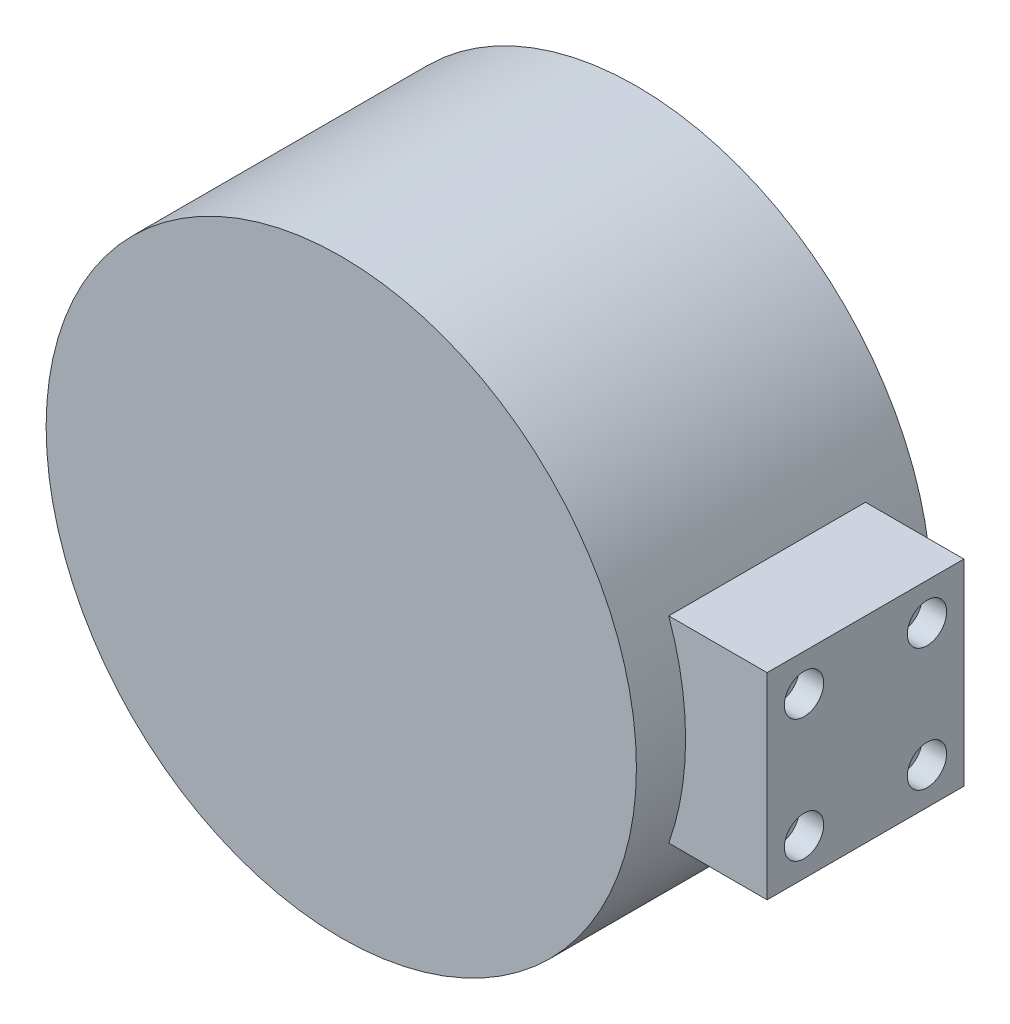
ISO-10303-21;
HEADER;
FILE_DESCRIPTION(('STEP AP214'),'2;1');
FILE_NAME('part.step','',(''),(''),'','','');
FILE_SCHEMA(('AUTOMOTIVE_DESIGN { 1 0 10303 214 1 1 1 1 }'));
ENDSEC;
DATA;
#1=APPLICATION_CONTEXT('core data for automotive mechanical design processes');
#2=APPLICATION_PROTOCOL_DEFINITION('international standard','automotive_design',2000,#1);
#3=PRODUCT_CONTEXT('',#1,'mechanical');
#4=PRODUCT('Part','Part','',(#3));
#5=PRODUCT_RELATED_PRODUCT_CATEGORY('part','',(#4));
#6=PRODUCT_DEFINITION_FORMATION('','',#4);
#7=PRODUCT_DEFINITION_CONTEXT('part definition',#1,'design');
#8=PRODUCT_DEFINITION('design','',#6,#7);
#9=PRODUCT_DEFINITION_SHAPE('','',#8);
#10=(LENGTH_UNIT() NAMED_UNIT(*) SI_UNIT(.MILLI.,.METRE.));
#11=(NAMED_UNIT(*) PLANE_ANGLE_UNIT() SI_UNIT($,.RADIAN.));
#12=(NAMED_UNIT(*) SI_UNIT($,.STERADIAN.) SOLID_ANGLE_UNIT());
#13=UNCERTAINTY_MEASURE_WITH_UNIT(LENGTH_MEASURE(1.E-05),#10,'distance_accuracy_value','');
#14=(GEOMETRIC_REPRESENTATION_CONTEXT(3) GLOBAL_UNCERTAINTY_ASSIGNED_CONTEXT((#13)) GLOBAL_UNIT_ASSIGNED_CONTEXT((#10,
#11,#12)) REPRESENTATION_CONTEXT('',''));
#15=CARTESIAN_POINT('',(0.,0.,0.));
#16=DIRECTION('',(0.,0.,1.));
#17=DIRECTION('',(1.,0.,0.));
#18=AXIS2_PLACEMENT_3D('',#15,#16,#17);
#19=CARTESIAN_POINT('',(56.5685424949238,-20.,60.));
#20=DIRECTION('',(0.,1.,0.));
#21=DIRECTION('',(-1.,0.,0.));
#22=AXIS2_PLACEMENT_3D('',#19,#20,#21);
#23=PLANE('',#22);
#24=DIRECTION('',(1.,0.,0.));
#25=VECTOR('',#24,1.);
#26=CARTESIAN_POINT('',(76.5685424949238,-20.,50.));
#27=LINE('',#26,#25);
#28=CARTESIAN_POINT('',(56.5685424949238,-20.,50.));
#29=VERTEX_POINT('',#28);
#30=CARTESIAN_POINT('',(76.5685424949238,-20.,50.));
#31=VERTEX_POINT('',#30);
#32=EDGE_CURVE('E76',#29,#31,#27,.T.);
#33=ORIENTED_EDGE('',*,*,#32,.F.);
#34=DIRECTION('',(0.,0.,-1.));
#35=VECTOR('',#34,1.);
#36=CARTESIAN_POINT('',(56.5685424949238,-20.,60.));
#37=LINE('',#36,#35);
#38=CARTESIAN_POINT('',(56.5685424949238,-20.,10.));
#39=VERTEX_POINT('',#38);
#40=EDGE_CURVE('E11',#29,#39,#37,.T.);
#41=ORIENTED_EDGE('',*,*,#40,.T.);
#42=DIRECTION('',(-1.,0.,0.));
#43=VECTOR('',#42,1.);
#44=CARTESIAN_POINT('',(76.5685424949238,-20.,10.));
#45=LINE('',#44,#43);
#46=CARTESIAN_POINT('',(76.5685424949238,-20.,10.));
#47=VERTEX_POINT('',#46);
#48=EDGE_CURVE('E107',#47,#39,#45,.T.);
#49=ORIENTED_EDGE('',*,*,#48,.F.);
#50=DIRECTION('',(0.,0.,-1.));
#51=VECTOR('',#50,1.);
#52=CARTESIAN_POINT('',(76.5685424949238,-20.,60.));
#53=LINE('',#52,#51);
#54=EDGE_CURVE('E41',#31,#47,#53,.T.);
#55=ORIENTED_EDGE('',*,*,#54,.F.);
#56=EDGE_LOOP('',(#33,#41,#49,#55));
#57=FACE_BOUND('',#56,.T.);
#58=ADVANCED_FACE('F33',(#57),#23,.F.);
#59=CARTESIAN_POINT('',(76.5685424949238,-20.,60.));
#60=DIRECTION('',(-1.,0.,0.));
#61=DIRECTION('',(0.,0.,1.));
#62=AXIS2_PLACEMENT_3D('',#59,#60,#61);
#63=PLANE('',#62);
#64=CARTESIAN_POINT('',(76.5685424949238,12.5,42.5));
#65=DIRECTION('',(1.,0.,0.));
#66=DIRECTION('',(0.,0.,-1.));
#67=AXIS2_PLACEMENT_3D('',#64,#65,#66);
#68=CIRCLE('',#67,4.00000000000001);
#69=CARTESIAN_POINT('',(76.5685424949238,12.5,38.5));
#70=VERTEX_POINT('',#69);
#71=EDGE_CURVE('E128',#70,#70,#68,.T.);
#72=ORIENTED_EDGE('',*,*,#71,.F.);
#73=EDGE_LOOP('',(#72));
#74=FACE_BOUND('',#73,.T.);
#75=CARTESIAN_POINT('',(76.5685424949238,-12.5,42.5));
#76=DIRECTION('',(1.,0.,0.));
#77=DIRECTION('',(0.,0.,-1.));
#78=AXIS2_PLACEMENT_3D('',#75,#76,#77);
#79=CIRCLE('',#78,4.00000000000001);
#80=CARTESIAN_POINT('',(76.5685424949238,-12.5,38.5));
#81=VERTEX_POINT('',#80);
#82=EDGE_CURVE('E134',#81,#81,#79,.T.);
#83=ORIENTED_EDGE('',*,*,#82,.F.);
#84=EDGE_LOOP('',(#83));
#85=FACE_BOUND('',#84,.T.);
#86=CARTESIAN_POINT('',(76.5685424949238,-12.5,17.5));
#87=DIRECTION('',(1.,0.,0.));
#88=DIRECTION('',(0.,0.,-1.));
#89=AXIS2_PLACEMENT_3D('',#86,#87,#88);
#90=CIRCLE('',#89,4.);
#91=CARTESIAN_POINT('',(76.5685424949238,-12.5,13.5));
#92=VERTEX_POINT('',#91);
#93=EDGE_CURVE('E140',#92,#92,#90,.T.);
#94=ORIENTED_EDGE('',*,*,#93,.F.);
#95=EDGE_LOOP('',(#94));
#96=FACE_BOUND('',#95,.T.);
#97=CARTESIAN_POINT('',(76.5685424949238,12.5,17.5));
#98=DIRECTION('',(1.,0.,0.));
#99=DIRECTION('',(0.,0.,-1.));
#100=AXIS2_PLACEMENT_3D('',#97,#98,#99);
#101=CIRCLE('',#100,4.);
#102=CARTESIAN_POINT('',(76.5685424949238,12.5,13.5));
#103=VERTEX_POINT('',#102);
#104=EDGE_CURVE('E122',#103,#103,#101,.T.);
#105=ORIENTED_EDGE('',*,*,#104,.F.);
#106=EDGE_LOOP('',(#105));
#107=FACE_BOUND('',#106,.T.);
#108=DIRECTION('',(0.,1.,0.));
#109=VECTOR('',#108,1.);
#110=CARTESIAN_POINT('',(76.5685424949238,20.,50.));
#111=LINE('',#110,#109);
#112=CARTESIAN_POINT('',(76.5685424949238,20.,50.));
#113=VERTEX_POINT('',#112);
#114=EDGE_CURVE('E82',#31,#113,#111,.T.);
#115=ORIENTED_EDGE('',*,*,#114,.F.);
#116=ORIENTED_EDGE('',*,*,#54,.T.);
#117=DIRECTION('',(0.,-1.,0.));
#118=VECTOR('',#117,1.);
#119=CARTESIAN_POINT('',(76.5685424949238,20.,10.));
#120=LINE('',#119,#118);
#121=CARTESIAN_POINT('',(76.5685424949238,20.,10.));
#122=VERTEX_POINT('',#121);
#123=EDGE_CURVE('E104',#122,#47,#120,.T.);
#124=ORIENTED_EDGE('',*,*,#123,.F.);
#125=DIRECTION('',(0.,0.,-1.));
#126=VECTOR('',#125,1.);
#127=CARTESIAN_POINT('',(76.5685424949238,20.,60.));
#128=LINE('',#127,#126);
#129=EDGE_CURVE('E91',#113,#122,#128,.T.);
#130=ORIENTED_EDGE('',*,*,#129,.F.);
#131=EDGE_LOOP('',(#115,#116,#124,#130));
#132=FACE_BOUND('',#131,.T.);
#133=ADVANCED_FACE('F103',(#74,#85,#96,#107,#132),#63,.F.);
#134=CARTESIAN_POINT('',(76.5685424949238,20.,60.));
#135=DIRECTION('',(0.,-1.,0.));
#136=DIRECTION('',(1.,0.,0.));
#137=AXIS2_PLACEMENT_3D('',#134,#135,#136);
#138=PLANE('',#137);
#139=DIRECTION('',(-1.,0.,0.));
#140=VECTOR('',#139,1.);
#141=CARTESIAN_POINT('',(76.5685424949238,20.,50.));
#142=LINE('',#141,#140);
#143=CARTESIAN_POINT('',(56.5685424949238,20.,50.));
#144=VERTEX_POINT('',#143);
#145=EDGE_CURVE('E77',#113,#144,#142,.T.);
#146=ORIENTED_EDGE('',*,*,#145,.F.);
#147=ORIENTED_EDGE('',*,*,#129,.T.);
#148=DIRECTION('',(1.,0.,0.));
#149=VECTOR('',#148,1.);
#150=CARTESIAN_POINT('',(76.5685424949238,20.,10.));
#151=LINE('',#150,#149);
#152=CARTESIAN_POINT('',(56.5685424949238,20.,10.));
#153=VERTEX_POINT('',#152);
#154=EDGE_CURVE('E90',#153,#122,#151,.T.);
#155=ORIENTED_EDGE('',*,*,#154,.F.);
#156=DIRECTION('',(0.,0.,-1.));
#157=VECTOR('',#156,1.);
#158=CARTESIAN_POINT('',(56.5685424949238,20.,60.));
#159=LINE('',#158,#157);
#160=EDGE_CURVE('E48',#144,#153,#159,.T.);
#161=ORIENTED_EDGE('',*,*,#160,.F.);
#162=EDGE_LOOP('',(#146,#147,#155,#161));
#163=FACE_BOUND('',#162,.T.);
#164=ADVANCED_FACE('F88',(#163),#138,.F.);
#165=CARTESIAN_POINT('',(0.,0.,60.));
#166=DIRECTION('',(0.,0.,1.));
#167=DIRECTION('',(1.,0.,0.));
#168=AXIS2_PLACEMENT_3D('',#165,#166,#167);
#169=PLANE('',#168);
#170=CARTESIAN_POINT('',(0.,0.,60.));
#171=DIRECTION('',(0.,0.,1.));
#172=DIRECTION('',(1.,0.,0.));
#173=AXIS2_PLACEMENT_3D('',#170,#171,#172);
#174=CIRCLE('',#173,60.);
#175=CARTESIAN_POINT('',(60.,0.,60.));
#176=VERTEX_POINT('',#175);
#177=EDGE_CURVE('E92',#176,#176,#174,.T.);
#178=ORIENTED_EDGE('',*,*,#177,.T.);
#179=EDGE_LOOP('',(#178));
#180=FACE_BOUND('',#179,.T.);
#181=ADVANCED_FACE('F182',(#180),#169,.T.);
#182=CARTESIAN_POINT('',(0.,0.,60.));
#183=DIRECTION('',(0.,0.,-1.));
#184=DIRECTION('',(-1.,0.,0.));
#185=AXIS2_PLACEMENT_3D('',#182,#183,#184);
#186=CYLINDRICAL_SURFACE('',#185,60.);
#187=CARTESIAN_POINT('',(0.,0.,50.));
#188=DIRECTION('',(0.,0.,-1.));
#189=DIRECTION('',(1.,0.,0.));
#190=AXIS2_PLACEMENT_3D('',#187,#188,#189);
#191=CIRCLE('',#190,60.);
#192=EDGE_CURVE('E72',#144,#29,#191,.T.);
#193=ORIENTED_EDGE('',*,*,#192,.F.);
#194=ORIENTED_EDGE('',*,*,#160,.T.);
#195=CARTESIAN_POINT('',(0.,0.,10.));
#196=DIRECTION('',(0.,0.,1.));
#197=DIRECTION('',(-1.,0.,0.));
#198=AXIS2_PLACEMENT_3D('',#195,#196,#197);
#199=CIRCLE('',#198,60.);
#200=EDGE_CURVE('E109',#39,#153,#199,.T.);
#201=ORIENTED_EDGE('',*,*,#200,.F.);
#202=ORIENTED_EDGE('',*,*,#40,.F.);
#203=EDGE_LOOP('',(#193,#194,#201,#202));
#204=FACE_BOUND('',#203,.T.);
#205=CARTESIAN_POINT('',(0.,0.,0.));
#206=DIRECTION('',(0.,0.,1.));
#207=DIRECTION('',(1.,0.,0.));
#208=AXIS2_PLACEMENT_3D('',#205,#206,#207);
#209=CIRCLE('',#208,60.);
#210=CARTESIAN_POINT('',(60.,0.,0.));
#211=VERTEX_POINT('',#210);
#212=EDGE_CURVE('E96',#211,#211,#209,.T.);
#213=ORIENTED_EDGE('',*,*,#212,.T.);
#214=EDGE_LOOP('',(#213));
#215=FACE_BOUND('',#214,.T.);
#216=ORIENTED_EDGE('',*,*,#177,.F.);
#217=EDGE_LOOP('',(#216));
#218=FACE_BOUND('',#217,.T.);
#219=ADVANCED_FACE('F35',(#204,#215,#218),#186,.T.);
#220=CARTESIAN_POINT('',(0.,0.,0.));
#221=DIRECTION('',(0.,0.,1.));
#222=DIRECTION('',(1.,0.,0.));
#223=AXIS2_PLACEMENT_3D('',#220,#221,#222);
#224=PLANE('',#223);
#225=CARTESIAN_POINT('',(0.,0.,0.));
#226=DIRECTION('',(0.,0.,-1.));
#227=DIRECTION('',(-1.,0.,0.));
#228=AXIS2_PLACEMENT_3D('',#225,#226,#227);
#229=CIRCLE('',#228,40.);
#230=CARTESIAN_POINT('',(-40.,0.,0.));
#231=VERTEX_POINT('',#230);
#232=EDGE_CURVE('E116',#231,#231,#229,.T.);
#233=ORIENTED_EDGE('',*,*,#232,.F.);
#234=EDGE_LOOP('',(#233));
#235=FACE_BOUND('',#234,.T.);
#236=ORIENTED_EDGE('',*,*,#212,.F.);
#237=EDGE_LOOP('',(#236));
#238=FACE_BOUND('',#237,.T.);
#239=ADVANCED_FACE('F183',(#235,#238),#224,.F.);
#240=CARTESIAN_POINT('',(0.,0.,10.));
#241=DIRECTION('',(0.,0.,-1.));
#242=DIRECTION('',(-1.,0.,0.));
#243=AXIS2_PLACEMENT_3D('',#240,#241,#242);
#244=PLANE('',#243);
#245=ORIENTED_EDGE('',*,*,#154,.T.);
#246=ORIENTED_EDGE('',*,*,#123,.T.);
#247=ORIENTED_EDGE('',*,*,#48,.T.);
#248=ORIENTED_EDGE('',*,*,#200,.T.);
#249=EDGE_LOOP('',(#245,#246,#247,#248));
#250=FACE_BOUND('',#249,.T.);
#251=ADVANCED_FACE('F106',(#250),#244,.T.);
#252=CARTESIAN_POINT('',(0.,0.,50.));
#253=DIRECTION('',(0.,0.,1.));
#254=DIRECTION('',(1.,0.,0.));
#255=AXIS2_PLACEMENT_3D('',#252,#253,#254);
#256=PLANE('',#255);
#257=ORIENTED_EDGE('',*,*,#145,.T.);
#258=ORIENTED_EDGE('',*,*,#192,.T.);
#259=ORIENTED_EDGE('',*,*,#32,.T.);
#260=ORIENTED_EDGE('',*,*,#114,.T.);
#261=EDGE_LOOP('',(#257,#258,#259,#260));
#262=FACE_BOUND('',#261,.T.);
#263=ADVANCED_FACE('F80',(#262),#256,.T.);
#264=CARTESIAN_POINT('',(0.,0.,20.));
#265=DIRECTION('',(0.,0.,-1.));
#266=DIRECTION('',(-1.,0.,0.));
#267=AXIS2_PLACEMENT_3D('',#264,#265,#266);
#268=CYLINDRICAL_SURFACE('',#267,40.);
#269=CARTESIAN_POINT('',(0.,0.,20.));
#270=DIRECTION('',(0.,0.,-1.));
#271=DIRECTION('',(-1.,0.,0.));
#272=AXIS2_PLACEMENT_3D('',#269,#270,#271);
#273=CIRCLE('',#272,40.);
#274=CARTESIAN_POINT('',(-40.,0.,20.));
#275=VERTEX_POINT('',#274);
#276=EDGE_CURVE('E85',#275,#275,#273,.T.);
#277=ORIENTED_EDGE('',*,*,#276,.F.);
#278=EDGE_LOOP('',(#277));
#279=FACE_BOUND('',#278,.T.);
#280=ORIENTED_EDGE('',*,*,#232,.T.);
#281=EDGE_LOOP('',(#280));
#282=FACE_BOUND('',#281,.T.);
#283=ADVANCED_FACE('F172',(#279,#282),#268,.F.);
#284=CARTESIAN_POINT('',(0.,0.,20.));
#285=DIRECTION('',(0.,0.,-1.));
#286=DIRECTION('',(-1.,0.,0.));
#287=AXIS2_PLACEMENT_3D('',#284,#285,#286);
#288=PLANE('',#287);
#289=ORIENTED_EDGE('',*,*,#276,.T.);
#290=EDGE_LOOP('',(#289));
#291=FACE_BOUND('',#290,.T.);
#292=ADVANCED_FACE('F163',(#291),#288,.T.);
#293=CARTESIAN_POINT('',(71.5685424949238,12.5,17.5));
#294=DIRECTION('',(1.,0.,0.));
#295=DIRECTION('',(0.,0.,-1.));
#296=AXIS2_PLACEMENT_3D('',#293,#294,#295);
#297=CYLINDRICAL_SURFACE('',#296,4.);
#298=CARTESIAN_POINT('',(71.5685424949238,12.5,17.5));
#299=DIRECTION('',(1.,0.,0.));
#300=DIRECTION('',(0.,0.,-1.));
#301=AXIS2_PLACEMENT_3D('',#298,#299,#300);
#302=CIRCLE('',#301,4.);
#303=CARTESIAN_POINT('',(71.5685424949238,12.5,13.5));
#304=VERTEX_POINT('',#303);
#305=EDGE_CURVE('E119',#304,#304,#302,.T.);
#306=ORIENTED_EDGE('',*,*,#305,.F.);
#307=EDGE_LOOP('',(#306));
#308=FACE_BOUND('',#307,.T.);
#309=ORIENTED_EDGE('',*,*,#104,.T.);
#310=EDGE_LOOP('',(#309));
#311=FACE_BOUND('',#310,.T.);
#312=ADVANCED_FACE('F161',(#308,#311),#297,.F.);
#313=CARTESIAN_POINT('',(71.5685424949238,12.5,17.5));
#314=DIRECTION('',(1.,0.,0.));
#315=DIRECTION('',(0.,0.,-1.));
#316=AXIS2_PLACEMENT_3D('',#313,#314,#315);
#317=PLANE('',#316);
#318=ORIENTED_EDGE('',*,*,#305,.T.);
#319=EDGE_LOOP('',(#318));
#320=FACE_BOUND('',#319,.T.);
#321=ADVANCED_FACE('F151',(#320),#317,.T.);
#322=CARTESIAN_POINT('',(71.5685424949238,-12.5,17.5));
#323=DIRECTION('',(1.,0.,0.));
#324=DIRECTION('',(0.,0.,-1.));
#325=AXIS2_PLACEMENT_3D('',#322,#323,#324);
#326=CYLINDRICAL_SURFACE('',#325,4.);
#327=CARTESIAN_POINT('',(71.5685424949238,-12.5,17.5));
#328=DIRECTION('',(1.,0.,0.));
#329=DIRECTION('',(0.,0.,-1.));
#330=AXIS2_PLACEMENT_3D('',#327,#328,#329);
#331=CIRCLE('',#330,4.);
#332=CARTESIAN_POINT('',(71.5685424949238,-12.5,13.5));
#333=VERTEX_POINT('',#332);
#334=EDGE_CURVE('E125',#333,#333,#331,.T.);
#335=ORIENTED_EDGE('',*,*,#334,.F.);
#336=EDGE_LOOP('',(#335));
#337=FACE_BOUND('',#336,.T.);
#338=ORIENTED_EDGE('',*,*,#93,.T.);
#339=EDGE_LOOP('',(#338));
#340=FACE_BOUND('',#339,.T.);
#341=ADVANCED_FACE('F148',(#337,#340),#326,.F.);
#342=CARTESIAN_POINT('',(71.5685424949238,-12.5,17.5));
#343=DIRECTION('',(1.,0.,0.));
#344=DIRECTION('',(0.,0.,-1.));
#345=AXIS2_PLACEMENT_3D('',#342,#343,#344);
#346=PLANE('',#345);
#347=ORIENTED_EDGE('',*,*,#334,.T.);
#348=EDGE_LOOP('',(#347));
#349=FACE_BOUND('',#348,.T.);
#350=ADVANCED_FACE('F146',(#349),#346,.T.);
#351=CARTESIAN_POINT('',(71.5685424949238,-12.5,42.5));
#352=DIRECTION('',(1.,0.,0.));
#353=DIRECTION('',(0.,0.,-1.));
#354=AXIS2_PLACEMENT_3D('',#351,#352,#353);
#355=CYLINDRICAL_SURFACE('',#354,4.00000000000001);
#356=CARTESIAN_POINT('',(71.5685424949238,-12.5,42.5));
#357=DIRECTION('',(1.,0.,0.));
#358=DIRECTION('',(0.,0.,-1.));
#359=AXIS2_PLACEMENT_3D('',#356,#357,#358);
#360=CIRCLE('',#359,4.00000000000001);
#361=CARTESIAN_POINT('',(71.5685424949238,-12.5,38.5));
#362=VERTEX_POINT('',#361);
#363=EDGE_CURVE('E137',#362,#362,#360,.T.);
#364=ORIENTED_EDGE('',*,*,#363,.F.);
#365=EDGE_LOOP('',(#364));
#366=FACE_BOUND('',#365,.T.);
#367=ORIENTED_EDGE('',*,*,#82,.T.);
#368=EDGE_LOOP('',(#367));
#369=FACE_BOUND('',#368,.T.);
#370=ADVANCED_FACE('F261',(#366,#369),#355,.F.);
#371=CARTESIAN_POINT('',(71.5685424949238,-12.5,42.5));
#372=DIRECTION('',(1.,0.,0.));
#373=DIRECTION('',(0.,0.,-1.));
#374=AXIS2_PLACEMENT_3D('',#371,#372,#373);
#375=PLANE('',#374);
#376=ORIENTED_EDGE('',*,*,#363,.T.);
#377=EDGE_LOOP('',(#376));
#378=FACE_BOUND('',#377,.T.);
#379=ADVANCED_FACE('F269',(#378),#375,.T.);
#380=CARTESIAN_POINT('',(71.5685424949238,12.5,42.5));
#381=DIRECTION('',(1.,0.,0.));
#382=DIRECTION('',(0.,0.,-1.));
#383=AXIS2_PLACEMENT_3D('',#380,#381,#382);
#384=CYLINDRICAL_SURFACE('',#383,4.00000000000001);
#385=CARTESIAN_POINT('',(71.5685424949238,12.5,42.5));
#386=DIRECTION('',(1.,0.,0.));
#387=DIRECTION('',(0.,0.,-1.));
#388=AXIS2_PLACEMENT_3D('',#385,#386,#387);
#389=CIRCLE('',#388,4.00000000000001);
#390=CARTESIAN_POINT('',(71.5685424949238,12.5,38.5));
#391=VERTEX_POINT('',#390);
#392=EDGE_CURVE('E131',#391,#391,#389,.T.);
#393=ORIENTED_EDGE('',*,*,#392,.F.);
#394=EDGE_LOOP('',(#393));
#395=FACE_BOUND('',#394,.T.);
#396=ORIENTED_EDGE('',*,*,#71,.T.);
#397=EDGE_LOOP('',(#396));
#398=FACE_BOUND('',#397,.T.);
#399=ADVANCED_FACE('F278',(#395,#398),#384,.F.);
#400=CARTESIAN_POINT('',(71.5685424949238,12.5,42.5));
#401=DIRECTION('',(1.,0.,0.));
#402=DIRECTION('',(0.,0.,-1.));
#403=AXIS2_PLACEMENT_3D('',#400,#401,#402);
#404=PLANE('',#403);
#405=ORIENTED_EDGE('',*,*,#392,.T.);
#406=EDGE_LOOP('',(#405));
#407=FACE_BOUND('',#406,.T.);
#408=ADVANCED_FACE('F287',(#407),#404,.T.);
#409=CLOSED_SHELL('',(#58,#133,#164,#181,#219,#239,#251,#263,#283,#292,#312,#321,#341,#350,#370,
#379,#399,#408));
#410=MANIFOLD_SOLID_BREP('B2',#409);
#411=ADVANCED_BREP_SHAPE_REPRESENTATION('',(#18,#410),#14);
#412=SHAPE_DEFINITION_REPRESENTATION(#9,#411);
ENDSEC;
END-ISO-10303-21;
